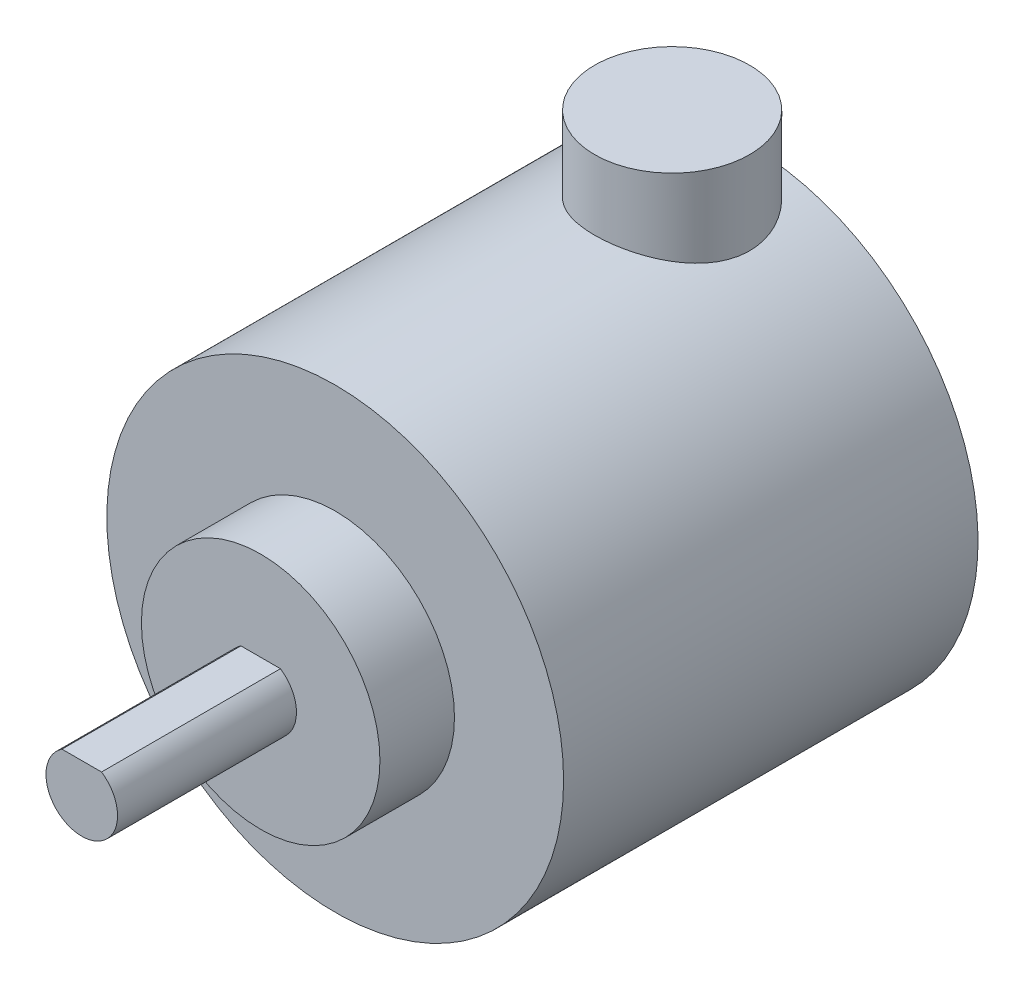
ISO-10303-21;
HEADER;
FILE_DESCRIPTION(('STEP AP214'),'2;1');
FILE_NAME('part.step','',(''),(''),'','','');
FILE_SCHEMA(('AUTOMOTIVE_DESIGN { 1 0 10303 214 1 1 1 1 }'));
ENDSEC;
DATA;
#1=APPLICATION_CONTEXT('core data for automotive mechanical design processes');
#2=APPLICATION_PROTOCOL_DEFINITION('international standard','automotive_design',2000,#1);
#3=PRODUCT_CONTEXT('',#1,'mechanical');
#4=PRODUCT('Part','Part','',(#3));
#5=PRODUCT_RELATED_PRODUCT_CATEGORY('part','',(#4));
#6=PRODUCT_DEFINITION_FORMATION('','',#4);
#7=PRODUCT_DEFINITION_CONTEXT('part definition',#1,'design');
#8=PRODUCT_DEFINITION('design','',#6,#7);
#9=PRODUCT_DEFINITION_SHAPE('','',#8);
#10=(LENGTH_UNIT() NAMED_UNIT(*) SI_UNIT(.MILLI.,.METRE.));
#11=(NAMED_UNIT(*) PLANE_ANGLE_UNIT() SI_UNIT($,.RADIAN.));
#12=(NAMED_UNIT(*) SI_UNIT($,.STERADIAN.) SOLID_ANGLE_UNIT());
#13=UNCERTAINTY_MEASURE_WITH_UNIT(LENGTH_MEASURE(1.E-05),#10,'distance_accuracy_value','');
#14=(GEOMETRIC_REPRESENTATION_CONTEXT(3) GLOBAL_UNCERTAINTY_ASSIGNED_CONTEXT((#13)) GLOBAL_UNIT_ASSIGNED_CONTEXT((#10,
#11,#12)) REPRESENTATION_CONTEXT('',''));
#15=CARTESIAN_POINT('',(0.,0.,0.));
#16=DIRECTION('',(0.,0.,1.));
#17=DIRECTION('',(1.,0.,0.));
#18=AXIS2_PLACEMENT_3D('',#15,#16,#17);
#19=CARTESIAN_POINT('',(0.,0.,34.75));
#20=DIRECTION('',(0.,0.,-1.));
#21=DIRECTION('',(-1.,0.,0.));
#22=AXIS2_PLACEMENT_3D('',#19,#20,#21);
#23=CYLINDRICAL_SURFACE('',#22,19.15);
#24=CARTESIAN_POINT('',(0.,0.,34.75));
#25=DIRECTION('',(0.,0.,1.));
#26=DIRECTION('',(1.,0.,0.));
#27=AXIS2_PLACEMENT_3D('',#24,#25,#26);
#28=CIRCLE('',#27,19.15);
#29=CARTESIAN_POINT('',(19.15,0.,34.75));
#30=VERTEX_POINT('',#29);
#31=EDGE_CURVE('E85',#30,#30,#28,.T.);
#32=ORIENTED_EDGE('',*,*,#31,.F.);
#33=EDGE_LOOP('',(#32));
#34=FACE_BOUND('',#33,.T.);
#35=CARTESIAN_POINT('',(0.,0.,0.));
#36=DIRECTION('',(0.,0.,1.));
#37=DIRECTION('',(1.,0.,0.));
#38=AXIS2_PLACEMENT_3D('',#35,#36,#37);
#39=CIRCLE('',#38,19.15);
#40=CARTESIAN_POINT('',(0.,19.15,0.));
#41=VERTEX_POINT('',#40);
#42=EDGE_CURVE('E53',#41,#41,#39,.T.);
#43=ORIENTED_EDGE('',*,*,#42,.T.);
#44=CARTESIAN_POINT('',(0.,19.15,0.));
#45=CARTESIAN_POINT('',(-0.177111806790201,19.1500001130655,-1.66143290630455E-07));
#46=CARTESIAN_POINT('',(-0.354221122925907,19.1475373566144,0.00724466132958994));
#47=CARTESIAN_POINT('',(-0.707186463893901,19.137752428606,0.0361580254000941));
#48=CARTESIAN_POINT('',(-0.883042019638498,19.1304285257543,0.0578317008311467));
#49=CARTESIAN_POINT('',(-1.23208834398768,19.1111224830327,0.115390701174901));
#50=CARTESIAN_POINT('',(-1.40527997714656,19.0991418890927,0.151271309738562));
#51=CARTESIAN_POINT('',(-1.74789660425077,19.0708394765471,0.236929554055904));
#52=CARTESIAN_POINT('',(-1.91732011458658,19.0545159797026,0.286712562519166));
#53=CARTESIAN_POINT('',(-2.25082328570757,19.0180014141644,0.399612895389175));
#54=CARTESIAN_POINT('',(-2.4149135525972,18.9978186509517,0.462701614224992));
#55=CARTESIAN_POINT('',(-2.73713045356237,18.9540777781514,0.601786559133724));
#56=CARTESIAN_POINT('',(-2.89525485384683,18.9305184198074,0.677787562456081));
#57=CARTESIAN_POINT('',(-3.2044775544452,18.8806342280472,0.842087675630392));
#58=CARTESIAN_POINT('',(-3.35557724103923,18.8543099436414,0.930384345155936));
#59=CARTESIAN_POINT('',(-3.64995300866277,18.7995417308819,1.11870035402043));
#60=CARTESIAN_POINT('',(-3.79322625276099,18.7710970426429,1.21872390332772));
#61=CARTESIAN_POINT('',(-4.07553883418773,18.7118665115558,1.43320539488021));
#62=CARTESIAN_POINT('',(-4.21429518213755,18.6810348484503,1.54802328793073));
#63=CARTESIAN_POINT('',(-4.48172691406864,18.6186863261704,1.78868536272117));
#64=CARTESIAN_POINT('',(-4.61040206442189,18.587169451138,1.91452979985408));
#65=CARTESIAN_POINT('',(-4.85694557689182,18.5242752612902,2.17652364944316));
#66=CARTESIAN_POINT('',(-4.97480966194558,18.4928980063423,2.31267710178803));
#67=CARTESIAN_POINT('',(-5.198898669749,18.4311545716468,2.59438407569285));
#68=CARTESIAN_POINT('',(-5.30512756147663,18.4007880495957,2.73993436472156));
#69=CARTESIAN_POINT('',(-5.50834251351435,18.3409984516939,3.04418766087037));
#70=CARTESIAN_POINT('',(-5.60494811172167,18.3116323525251,3.20315635600638));
#71=CARTESIAN_POINT('',(-5.784327213181,18.2557630643612,3.52911617865274));
#72=CARTESIAN_POINT('',(-5.86710618641379,18.2292587446856,3.69610409983684));
#73=CARTESIAN_POINT('',(-6.01820011699551,18.1799364410917,4.03706629645715));
#74=CARTESIAN_POINT('',(-6.08651262865373,18.1571190806425,4.21104174729559));
#75=CARTESIAN_POINT('',(-6.20800072818505,18.1159417403308,4.56463093000764));
#76=CARTESIAN_POINT('',(-6.26118326769804,18.097579713986,4.74424203026254));
#77=CARTESIAN_POINT('',(-6.35036186926822,18.0664760858681,5.1015590793628));
#78=CARTESIAN_POINT('',(-6.38688571772156,18.0535630296016,5.27911840248297));
#79=CARTESIAN_POINT('',(-6.44498811999897,18.0329027687945,5.63689171725841));
#80=CARTESIAN_POINT('',(-6.46657294603764,18.0251533963092,5.81710456232431));
#81=CARTESIAN_POINT('',(-6.49459504340378,18.0150758530907,6.17884148015608));
#82=CARTESIAN_POINT('',(-6.50103351936509,18.0127472512278,6.36036544749262));
#83=CARTESIAN_POINT('',(-6.49869725202439,18.0135903349873,6.72329978742619));
#84=CARTESIAN_POINT('',(-6.48992295891756,18.0167618578433,6.90471016322584));
#85=CARTESIAN_POINT('',(-6.45803966699562,18.0282137305565,7.25733060394627));
#86=CARTESIAN_POINT('',(-6.43563689030269,18.036242284183,7.4286132902002));
#87=CARTESIAN_POINT('',(-6.37732867264082,18.0569414696561,7.76863805767904));
#88=CARTESIAN_POINT('',(-6.34141869579503,18.0696136608538,7.93737926562605));
#89=CARTESIAN_POINT('',(-6.25643117798308,18.0992151639767,8.27107496639378));
#90=CARTESIAN_POINT('',(-6.20735728893636,18.1161432951416,8.43603049567701));
#91=CARTESIAN_POINT('',(-6.09642999454602,18.1537728680482,8.76120889329794));
#92=CARTESIAN_POINT('',(-6.03457173159021,18.1744757437068,8.92142993617091));
#93=CARTESIAN_POINT('',(-5.89746997382135,18.2194300919505,9.23864646045242));
#94=CARTESIAN_POINT('',(-5.82202649412646,18.2437334613008,9.3955480985802));
#95=CARTESIAN_POINT('',(-5.65898313496542,18.2949640784044,9.70251863617628));
#96=CARTESIAN_POINT('',(-5.57137910502573,18.321892221071,9.85258517945897));
#97=CARTESIAN_POINT('',(-5.38462039213438,18.3776455829498,10.1449911880121));
#98=CARTESIAN_POINT('',(-5.28546484117394,18.4064709446525,10.2873300714282));
#99=CARTESIAN_POINT('',(-5.07622773739983,18.4652706321871,10.5634868865268));
#100=CARTESIAN_POINT('',(-4.96614578332265,18.4952450001906,10.6973045049761));
#101=CARTESIAN_POINT('',(-4.72941858108454,18.557232289174,10.9627255409414));
#102=CARTESIAN_POINT('',(-4.60219763656238,18.5892672886008,11.0938109313744));
#103=CARTESIAN_POINT('',(-4.33716305152147,18.6528839716768,11.3448240594946));
#104=CARTESIAN_POINT('',(-4.1993527449162,18.6844657943164,11.464755282845));
#105=CARTESIAN_POINT('',(-3.91387634611394,18.7463438912748,11.6927795422505));
#106=CARTESIAN_POINT('',(-3.76620552531858,18.7766395372514,11.8008668319865));
#107=CARTESIAN_POINT('',(-3.46204044821912,18.835093474582,12.0043384021524));
#108=CARTESIAN_POINT('',(-3.30554972208709,18.8632526106349,12.0997277142778));
#109=CARTESIAN_POINT('',(-2.98290480538652,18.9169716181894,12.2781167095126));
#110=CARTESIAN_POINT('',(-2.81666273322922,18.9424992212899,12.3609673529421));
#111=CARTESIAN_POINT('',(-2.47731680886053,18.9898587414933,12.5122706474753));
#112=CARTESIAN_POINT('',(-2.30421565665065,19.0116920953064,12.580728898369));
#113=CARTESIAN_POINT('',(-1.95234941332479,19.0510410415853,12.7026604469698));
#114=CARTESIAN_POINT('',(-1.7735848400158,19.06855702751,12.7561351102514));
#115=CARTESIAN_POINT('',(-1.41173548621425,19.0987553539006,12.8475839607109));
#116=CARTESIAN_POINT('',(-1.22865091314283,19.1114379259393,12.8855588904999));
#117=CARTESIAN_POINT('',(-0.867878199422217,19.1311382640974,12.9442749149077));
#118=CARTESIAN_POINT('',(-0.690315446364259,19.1383842313722,12.9657114780425));
#119=CARTESIAN_POINT('',(-0.333896743918231,19.1479186639145,12.993879155518));
#120=CARTESIAN_POINT('',(-0.155040836973554,19.1502072911555,13.000610750321));
#121=CARTESIAN_POINT('',(0.202581812778011,19.1497632030357,12.9993023207749));
#122=CARTESIAN_POINT('',(0.381348565115335,19.1470312669726,12.9912645889379));
#123=CARTESIAN_POINT('',(0.73746663723116,19.1366238947675,12.9605017980466));
#124=CARTESIAN_POINT('',(0.914817972200623,19.1289485117533,12.9377768968375));
#125=CARTESIAN_POINT('',(1.26141502338232,19.1091743291602,12.8787764369005));
#126=CARTESIAN_POINT('',(1.43074303111326,19.0972174913317,12.8429350306727));
#127=CARTESIAN_POINT('',(1.76573680447721,19.0691619107638,12.7579584560627));
#128=CARTESIAN_POINT('',(1.93140133304751,19.0530617914545,12.7088188691928));
#129=CARTESIAN_POINT('',(2.25788713133803,19.0171347167937,12.5976778770325));
#130=CARTESIAN_POINT('',(2.41870968824139,18.9973087622458,12.5356799251893));
#131=CARTESIAN_POINT('',(2.7346223428478,18.9544127927023,12.3992758343841));
#132=CARTESIAN_POINT('',(2.88971024432214,18.9313415507654,12.3248650005142));
#133=CARTESIAN_POINT('',(3.19719470243346,18.8818784226713,12.1620670874994));
#134=CARTESIAN_POINT('',(3.34941151985061,18.8554148359072,12.0733623455951));
#135=CARTESIAN_POINT('',(3.64592436373912,18.8003320811628,11.8840678221434));
#136=CARTESIAN_POINT('',(3.79021763506824,18.7717121714978,11.7834739444045));
#137=CARTESIAN_POINT('',(4.07001601694165,18.7130410882033,11.5710770809549));
#138=CARTESIAN_POINT('',(4.20552020777268,18.6829897653556,11.4592729252768));
#139=CARTESIAN_POINT('',(4.46695961711257,18.6222122001711,11.2251523899952));
#140=CARTESIAN_POINT('',(4.59289457160932,18.5914859392432,11.1028357205531));
#141=CARTESIAN_POINT('',(4.84020963332944,18.5286781254429,10.8423648990324));
#142=CARTESIAN_POINT('',(4.96109016103401,18.496601435632,10.7037346779743));
#143=CARTESIAN_POINT('',(5.19073527327617,18.4334735758231,10.4166372565163));
#144=CARTESIAN_POINT('',(5.29950384819835,18.4024220704556,10.2681733217779));
#145=CARTESIAN_POINT('',(5.50426584321646,18.3422178170627,9.96221812403002));
#146=CARTESIAN_POINT('',(5.6002537726911,18.313065887832,9.8047230224935));
#147=CARTESIAN_POINT('',(5.77864218053168,18.2575606707396,9.48182824930424));
#148=CARTESIAN_POINT('',(5.86104832944451,18.2312062165447,9.31643191389917));
#149=CARTESIAN_POINT('',(6.01158016622488,18.1821250317741,8.97891440463895));
#150=CARTESIAN_POINT('',(6.0797182569993,18.1593951545678,8.80679922705975));
#151=CARTESIAN_POINT('',(6.20116737744665,18.1182818388262,8.45698407437394));
#152=CARTESIAN_POINT('',(6.25448452700752,18.0998966067642,8.27928643822244));
#153=CARTESIAN_POINT('',(6.34579988263735,18.0680841606849,7.91959349039022));
#154=CARTESIAN_POINT('',(6.38380095788544,18.0546560180895,7.73759899041474));
#155=CARTESIAN_POINT('',(6.44409901153872,18.033222589254,7.37071369393047));
#156=CARTESIAN_POINT('',(6.46639682122312,18.0252170159618,7.18582305126371));
#157=CARTESIAN_POINT('',(6.49428165349164,18.0151882900984,6.82457882516764));
#158=CARTESIAN_POINT('',(6.50069798011711,18.01286831443,6.64829700562519));
#159=CARTESIAN_POINT('',(6.49918156547928,18.0134155878694,6.29574048829984));
#160=CARTESIAN_POINT('',(6.49124395247405,18.0162845981244,6.11946581324859));
#161=CARTESIAN_POINT('',(6.46109617645081,18.0271181988721,5.7683807849582));
#162=CARTESIAN_POINT('',(6.4388923044976,18.0350805433246,5.59356982066361));
#163=CARTESIAN_POINT('',(6.38042453587455,18.0558478979497,5.24654227698688));
#164=CARTESIAN_POINT('',(6.34415535600666,18.068654727759,5.07432669776248));
#165=CARTESIAN_POINT('',(6.25879860412994,18.0983959205114,4.73732501634808));
#166=CARTESIAN_POINT('',(6.20999431458919,18.1152385750117,4.57245887124062));
#167=CARTESIAN_POINT('',(6.09962440173799,18.15269887753,4.24743502209273));
#168=CARTESIAN_POINT('',(6.0380542584946,18.173317862309,4.08727900873745));
#169=CARTESIAN_POINT('',(5.90265482090694,18.2177451443301,3.77273395992094));
#170=CARTESIAN_POINT('',(5.82882769495815,18.2415528773036,3.61834391030455));
#171=CARTESIAN_POINT('',(5.66940755570187,18.2917276504752,3.31613169968525));
#172=CARTESIAN_POINT('',(5.58381030981787,18.318095610333,3.16831192679507));
#173=CARTESIAN_POINT('',(5.39734437098456,18.3739234097322,2.87364954905835));
#174=CARTESIAN_POINT('',(5.29596345370782,18.403468830553,2.72714714084008));
#175=CARTESIAN_POINT('',(5.08166179090383,18.4637916356801,2.44310865627632));
#176=CARTESIAN_POINT('',(4.9687406280322,18.4945690645166,2.30557290449809));
#177=CARTESIAN_POINT('',(4.7320089542554,18.5565504535429,2.04021092378697));
#178=CARTESIAN_POINT('',(4.60819383443073,18.5877545894993,1.91238884746634));
#179=CARTESIAN_POINT('',(4.35049354283668,18.6497523152396,1.66731813803294));
#180=CARTESIAN_POINT('',(4.21661165995459,18.6805460352721,1.55006607890805));
#181=CARTESIAN_POINT('',(3.9337714898634,18.742191551936,1.32218448576877));
#182=CARTESIAN_POINT('',(3.78441836399195,18.7729928838616,1.21203067857626));
#183=CARTESIAN_POINT('',(3.47659838854036,18.8324274133069,1.00475849512041));
#184=CARTESIAN_POINT('',(3.31813497510173,18.8610614189625,0.907635249581585));
#185=CARTESIAN_POINT('',(2.99303649524318,18.9153745523958,0.727105638748167));
#186=CARTESIAN_POINT('',(2.8263994253573,18.941052950503,0.643702658494676));
#187=CARTESIAN_POINT('',(2.48620386322742,18.988701152453,0.4913807253735));
#188=CARTESIAN_POINT('',(2.31264849273747,19.0106726060826,0.422455325850975));
#189=CARTESIAN_POINT('',(1.96547333202913,19.0496440785349,0.301645130926614));
#190=CARTESIAN_POINT('',(1.79203461043261,19.0667810940332,0.249284164987416));
#191=CARTESIAN_POINT('',(1.4410907710342,19.0965114824409,0.15917501287733));
#192=CARTESIAN_POINT('',(1.26358735882104,19.1091067252757,0.121420812383278));
#193=CARTESIAN_POINT('',(0.905780207610436,19.129405855333,0.0608631522531734));
#194=CARTESIAN_POINT('',(0.725476630818803,19.1371100248071,0.0380588298942887));
#195=CARTESIAN_POINT('',(0.363447812838707,19.147406996518,0.00762746554868549));
#196=CARTESIAN_POINT('',(0.181722595408385,19.149999883991,1.70468533579017E-07));
#197=CARTESIAN_POINT('',(0.,19.15,0.));
#198=B_SPLINE_CURVE_WITH_KNOTS('',3,(#44,#45,#46,#47,#48,#49,#50,#51,#52,#53,#54,#55,#56,#57,
#58,#59,#60,#61,#62,#63,#64,#65,#66,#67,#68,#69,#70,#71,#72,#73,#74,#75,#76,#77,#78,#79,#80,#81,
#82,#83,#84,#85,#86,#87,#88,#89,#90,#91,#92,#93,#94,#95,#96,#97,#98,#99,#100,#101,#102,#103,
#104,#105,#106,#107,#108,#109,#110,#111,#112,#113,#114,#115,#116,#117,#118,#119,#120,#121,#122,
#123,#124,#125,#126,#127,#128,#129,#130,#131,#132,#133,#134,#135,#136,#137,#138,#139,#140,#141,
#142,#143,#144,#145,#146,#147,#148,#149,#150,#151,#152,#153,#154,#155,#156,#157,#158,#159,#160,
#161,#162,#163,#164,#165,#166,#167,#168,#169,#170,#171,#172,#173,#174,#175,#176,#177,#178,#179,
#180,#181,#182,#183,#184,#185,#186,#187,#188,#189,#190,#191,#192,#193,#194,#195,#196,#197),
.UNSPECIFIED.,.T.,.F.,(4,2,2,2,2,2,2,2,2,2,2,2,2,2,2,2,2,2,2,2,2,2,2,2,2,2,2,2,2,2,2,2,2,2,2,2,
2,2,2,2,2,2,2,2,2,2,2,2,2,2,2,2,2,2,2,2,2,2,2,2,2,2,2,2,2,2,2,2,2,2,2,2,2,2,2,2,4),(0.,
0.53116670615186,1.06252268857399,1.59370242170093,2.12508771885151,2.65534204332686,
3.18579297868396,3.71613878485601,4.24667557239907,4.79422088866785,5.34177889034522,
5.88955259038764,6.43713884897043,7.00141730400315,7.56547199216044,8.12962196304863,
8.69351230856244,9.23802542956976,9.78230979542315,10.3265508712736,10.8707758415406,
11.3889518774987,11.9073020786496,12.4255086280544,12.9439124409094,13.4706860814257,
13.9976399572505,14.5246334552146,15.0516463137639,15.6073776509677,16.1629347351685,
16.7187601765005,17.2743647068396,17.836127326908,18.3976709702877,18.9591634190279,
19.5206289628215,20.0569566845676,20.5932668823694,21.1294938405095,21.6657150358357,
22.1855916226842,22.7056411575957,23.2255512001748,23.7456583353691,24.2795248467828,
24.8135758316128,25.3476826111293,25.8818041211305,26.44126675686,27.0005445241582,
27.5600617896991,28.1193448554198,28.6781397117892,29.2367034857322,29.7951625745441,
30.3535920981467,30.8821807688943,31.4109488768551,31.9394839711379,32.4682177858789,
32.9859182048355,33.5038022369992,34.0215947472013,34.5395739467448,35.0807491176544,
35.6219438666897,36.1633686908315,36.7046173896236,37.2682932984924,37.8317579821096,
38.395361474982,38.958713468932,39.5039734427333,40.0490086666633,40.5940124351039,
41.1390071149379),.UNSPECIFIED.);
#199=EDGE_CURVE('E151',#41,#41,#198,.T.);
#200=ORIENTED_EDGE('',*,*,#199,.F.);
#201=EDGE_LOOP('',(#43,#200));
#202=FACE_BOUND('',#201,.T.);
#203=ADVANCED_FACE('F49',(#34,#202),#23,.T.);
#204=CARTESIAN_POINT('',(0.,0.,34.75));
#205=DIRECTION('',(0.,0.,1.));
#206=DIRECTION('',(1.,0.,0.));
#207=AXIS2_PLACEMENT_3D('',#204,#205,#206);
#208=PLANE('',#207);
#209=CARTESIAN_POINT('',(0.,0.,34.75));
#210=DIRECTION('',(0.,0.,1.));
#211=DIRECTION('',(1.,0.,0.));
#212=AXIS2_PLACEMENT_3D('',#209,#210,#211);
#213=CIRCLE('',#212,10.);
#214=CARTESIAN_POINT('',(10.,0.,34.75));
#215=VERTEX_POINT('',#214);
#216=EDGE_CURVE('E58',#215,#215,#213,.T.);
#217=ORIENTED_EDGE('',*,*,#216,.F.);
#218=EDGE_LOOP('',(#217));
#219=FACE_BOUND('',#218,.T.);
#220=ORIENTED_EDGE('',*,*,#31,.T.);
#221=EDGE_LOOP('',(#220));
#222=FACE_BOUND('',#221,.T.);
#223=ADVANCED_FACE('F101',(#219,#222),#208,.T.);
#224=CARTESIAN_POINT('',(0.,0.,0.));
#225=DIRECTION('',(0.,0.,1.));
#226=DIRECTION('',(1.,0.,0.));
#227=AXIS2_PLACEMENT_3D('',#224,#225,#226);
#228=PLANE('',#227);
#229=ORIENTED_EDGE('',*,*,#42,.F.);
#230=EDGE_LOOP('',(#229));
#231=FACE_BOUND('',#230,.T.);
#232=ADVANCED_FACE('F82',(#231),#228,.F.);
#233=CARTESIAN_POINT('',(0.,0.,41.));
#234=DIRECTION('',(0.,0.,-1.));
#235=DIRECTION('',(-1.,0.,0.));
#236=AXIS2_PLACEMENT_3D('',#233,#234,#235);
#237=CYLINDRICAL_SURFACE('',#236,10.);
#238=CARTESIAN_POINT('',(0.,0.,41.));
#239=DIRECTION('',(0.,0.,1.));
#240=DIRECTION('',(1.,0.,0.));
#241=AXIS2_PLACEMENT_3D('',#238,#239,#240);
#242=CIRCLE('',#241,10.);
#243=CARTESIAN_POINT('',(10.,0.,41.));
#244=VERTEX_POINT('',#243);
#245=EDGE_CURVE('E86',#244,#244,#242,.T.);
#246=ORIENTED_EDGE('',*,*,#245,.F.);
#247=EDGE_LOOP('',(#246));
#248=FACE_BOUND('',#247,.T.);
#249=ORIENTED_EDGE('',*,*,#216,.T.);
#250=EDGE_LOOP('',(#249));
#251=FACE_BOUND('',#250,.T.);
#252=ADVANCED_FACE('F99',(#248,#251),#237,.T.);
#253=CARTESIAN_POINT('',(0.,0.,41.));
#254=DIRECTION('',(0.,0.,1.));
#255=DIRECTION('',(1.,0.,0.));
#256=AXIS2_PLACEMENT_3D('',#253,#254,#255);
#257=PLANE('',#256);
#258=CARTESIAN_POINT('',(0.,0.,41.));
#259=DIRECTION('',(0.,0.,1.));
#260=DIRECTION('',(1.,0.,0.));
#261=AXIS2_PLACEMENT_3D('',#258,#259,#260);
#262=CIRCLE('',#261,3.);
#263=CARTESIAN_POINT('',(-1.6583123951777,2.5,41.));
#264=VERTEX_POINT('',#263);
#265=CARTESIAN_POINT('',(1.6583123951777,2.5,41.));
#266=VERTEX_POINT('',#265);
#267=EDGE_CURVE('E11',#264,#266,#262,.T.);
#268=ORIENTED_EDGE('',*,*,#267,.F.);
#269=DIRECTION('',(1.,0.,0.));
#270=VECTOR('',#269,1.);
#271=CARTESIAN_POINT('',(-1.6583123951777,2.5,41.));
#272=LINE('',#271,#270);
#273=EDGE_CURVE('E159',#264,#266,#272,.T.);
#274=ORIENTED_EDGE('',*,*,#273,.T.);
#275=EDGE_LOOP('',(#268,#274));
#276=FACE_BOUND('',#275,.T.);
#277=ORIENTED_EDGE('',*,*,#245,.T.);
#278=EDGE_LOOP('',(#277));
#279=FACE_BOUND('',#278,.T.);
#280=ADVANCED_FACE('F172',(#276,#279),#257,.T.);
#281=CARTESIAN_POINT('',(0.,0.,56.));
#282=DIRECTION('',(0.,0.,-1.));
#283=DIRECTION('',(-1.,0.,0.));
#284=AXIS2_PLACEMENT_3D('',#281,#282,#283);
#285=CYLINDRICAL_SURFACE('',#284,3.);
#286=CARTESIAN_POINT('',(0.,0.,56.));
#287=DIRECTION('',(0.,0.,1.));
#288=DIRECTION('',(1.,0.,0.));
#289=AXIS2_PLACEMENT_3D('',#286,#287,#288);
#290=CIRCLE('',#289,3.);
#291=CARTESIAN_POINT('',(-1.6583123951777,2.5,56.));
#292=VERTEX_POINT('',#291);
#293=CARTESIAN_POINT('',(1.6583123951777,2.5,56.));
#294=VERTEX_POINT('',#293);
#295=EDGE_CURVE('E89',#292,#294,#290,.T.);
#296=ORIENTED_EDGE('',*,*,#295,.F.);
#297=DIRECTION('',(0.,0.,1.));
#298=VECTOR('',#297,1.);
#299=CARTESIAN_POINT('',(-1.6583123951777,2.5,41.));
#300=LINE('',#299,#298);
#301=EDGE_CURVE('E66',#264,#292,#300,.T.);
#302=ORIENTED_EDGE('',*,*,#301,.F.);
#303=ORIENTED_EDGE('',*,*,#267,.T.);
#304=DIRECTION('',(0.,0.,1.));
#305=VECTOR('',#304,1.);
#306=CARTESIAN_POINT('',(1.6583123951777,2.5,41.));
#307=LINE('',#306,#305);
#308=EDGE_CURVE('E72',#266,#294,#307,.T.);
#309=ORIENTED_EDGE('',*,*,#308,.T.);
#310=EDGE_LOOP('',(#296,#302,#303,#309));
#311=FACE_BOUND('',#310,.T.);
#312=ADVANCED_FACE('F165',(#311),#285,.T.);
#313=CARTESIAN_POINT('',(0.,0.,56.));
#314=DIRECTION('',(0.,0.,1.));
#315=DIRECTION('',(1.,0.,0.));
#316=AXIS2_PLACEMENT_3D('',#313,#314,#315);
#317=PLANE('',#316);
#318=DIRECTION('',(1.,0.,0.));
#319=VECTOR('',#318,1.);
#320=CARTESIAN_POINT('',(-1.6583123951777,2.5,56.));
#321=LINE('',#320,#319);
#322=EDGE_CURVE('E78',#292,#294,#321,.T.);
#323=ORIENTED_EDGE('',*,*,#322,.F.);
#324=ORIENTED_EDGE('',*,*,#295,.T.);
#325=EDGE_LOOP('',(#323,#324));
#326=FACE_BOUND('',#325,.T.);
#327=ADVANCED_FACE('F168',(#326),#317,.T.);
#328=CARTESIAN_POINT('',(-1.6583123951777,2.5,41.));
#329=DIRECTION('',(0.,-1.,0.));
#330=DIRECTION('',(0.,0.,-1.));
#331=AXIS2_PLACEMENT_3D('',#328,#329,#330);
#332=PLANE('',#331);
#333=ORIENTED_EDGE('',*,*,#322,.T.);
#334=ORIENTED_EDGE('',*,*,#308,.F.);
#335=ORIENTED_EDGE('',*,*,#273,.F.);
#336=ORIENTED_EDGE('',*,*,#301,.T.);
#337=EDGE_LOOP('',(#333,#334,#335,#336));
#338=FACE_BOUND('',#337,.T.);
#339=ADVANCED_FACE('F116',(#338),#332,.F.);
#340=CARTESIAN_POINT('',(0.,25.,6.5));
#341=DIRECTION('',(0.,-1.,0.));
#342=DIRECTION('',(0.,0.,-1.));
#343=AXIS2_PLACEMENT_3D('',#340,#341,#342);
#344=CYLINDRICAL_SURFACE('',#343,6.5);
#345=CARTESIAN_POINT('',(0.,25.,6.5));
#346=DIRECTION('',(0.,1.,0.));
#347=DIRECTION('',(0.,0.,1.));
#348=AXIS2_PLACEMENT_3D('',#345,#346,#347);
#349=CIRCLE('',#348,6.5);
#350=CARTESIAN_POINT('',(0.,25.,13.));
#351=VERTEX_POINT('',#350);
#352=EDGE_CURVE('E158',#351,#351,#349,.T.);
#353=ORIENTED_EDGE('',*,*,#352,.F.);
#354=EDGE_LOOP('',(#353));
#355=FACE_BOUND('',#354,.T.);
#356=ORIENTED_EDGE('',*,*,#199,.T.);
#357=EDGE_LOOP('',(#356));
#358=FACE_BOUND('',#357,.T.);
#359=ADVANCED_FACE('F128',(#355,#358),#344,.T.);
#360=CARTESIAN_POINT('',(0.,25.,6.5));
#361=DIRECTION('',(0.,1.,0.));
#362=DIRECTION('',(0.,0.,1.));
#363=AXIS2_PLACEMENT_3D('',#360,#361,#362);
#364=PLANE('',#363);
#365=ORIENTED_EDGE('',*,*,#352,.T.);
#366=EDGE_LOOP('',(#365));
#367=FACE_BOUND('',#366,.T.);
#368=ADVANCED_FACE('F132',(#367),#364,.T.);
#369=CLOSED_SHELL('',(#203,#223,#232,#252,#280,#312,#327,#339,#359,#368));
#370=MANIFOLD_SOLID_BREP('B2',#369);
#371=ADVANCED_BREP_SHAPE_REPRESENTATION('',(#18,#370),#14);
#372=SHAPE_DEFINITION_REPRESENTATION(#9,#371);
ENDSEC;
END-ISO-10303-21;
